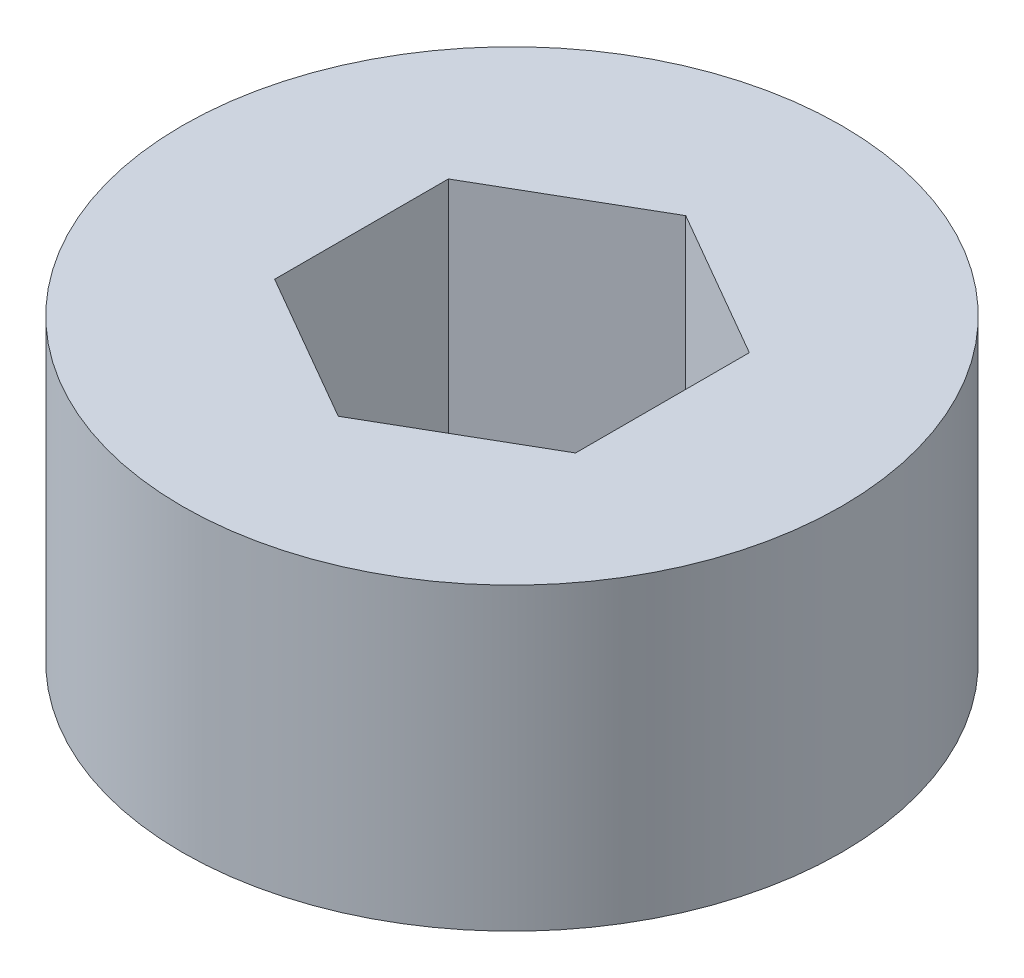
ISO-10303-21;
HEADER;
FILE_DESCRIPTION(('STEP AP214'),'2;1');
FILE_NAME('part.step','',(''),(''),'','','');
FILE_SCHEMA(('AUTOMOTIVE_DESIGN { 1 0 10303 214 1 1 1 1 }'));
ENDSEC;
DATA;
#1=APPLICATION_CONTEXT('core data for automotive mechanical design processes');
#2=APPLICATION_PROTOCOL_DEFINITION('international standard','automotive_design',2000,#1);
#3=PRODUCT_CONTEXT('',#1,'mechanical');
#4=PRODUCT('Part','Part','',(#3));
#5=PRODUCT_RELATED_PRODUCT_CATEGORY('part','',(#4));
#6=PRODUCT_DEFINITION_FORMATION('','',#4);
#7=PRODUCT_DEFINITION_CONTEXT('part definition',#1,'design');
#8=PRODUCT_DEFINITION('design','',#6,#7);
#9=PRODUCT_DEFINITION_SHAPE('','',#8);
#10=(LENGTH_UNIT() NAMED_UNIT(*) SI_UNIT(.MILLI.,.METRE.));
#11=(NAMED_UNIT(*) PLANE_ANGLE_UNIT() SI_UNIT($,.RADIAN.));
#12=(NAMED_UNIT(*) SI_UNIT($,.STERADIAN.) SOLID_ANGLE_UNIT());
#13=UNCERTAINTY_MEASURE_WITH_UNIT(LENGTH_MEASURE(1.E-05),#10,'distance_accuracy_value','');
#14=(GEOMETRIC_REPRESENTATION_CONTEXT(3) GLOBAL_UNCERTAINTY_ASSIGNED_CONTEXT((#13)) GLOBAL_UNIT_ASSIGNED_CONTEXT((#10,
#11,#12)) REPRESENTATION_CONTEXT('',''));
#15=CARTESIAN_POINT('',(0.,0.,0.));
#16=DIRECTION('',(0.,0.,1.));
#17=DIRECTION('',(1.,0.,0.));
#18=AXIS2_PLACEMENT_3D('',#15,#16,#17);
#19=CARTESIAN_POINT('',(0.,12.7,0.));
#20=DIRECTION('',(0.,-1.,0.));
#21=DIRECTION('',(0.,0.,-1.));
#22=AXIS2_PLACEMENT_3D('',#19,#20,#21);
#23=CYLINDRICAL_SURFACE('',#22,13.97);
#24=CARTESIAN_POINT('',(0.,12.7,0.));
#25=DIRECTION('',(0.,1.,0.));
#26=DIRECTION('',(0.,0.,1.));
#27=AXIS2_PLACEMENT_3D('',#24,#25,#26);
#28=CIRCLE('',#27,13.97);
#29=CARTESIAN_POINT('',(0.,12.7,13.97));
#30=VERTEX_POINT('',#29);
#31=EDGE_CURVE('E11',#30,#30,#28,.T.);
#32=ORIENTED_EDGE('',*,*,#31,.F.);
#33=EDGE_LOOP('',(#32));
#34=FACE_BOUND('',#33,.T.);
#35=CARTESIAN_POINT('',(0.,0.,0.));
#36=DIRECTION('',(0.,1.,0.));
#37=DIRECTION('',(0.,0.,1.));
#38=AXIS2_PLACEMENT_3D('',#35,#36,#37);
#39=CIRCLE('',#38,13.97);
#40=CARTESIAN_POINT('',(0.,0.,13.97));
#41=VERTEX_POINT('',#40);
#42=EDGE_CURVE('E38',#41,#41,#39,.T.);
#43=ORIENTED_EDGE('',*,*,#42,.T.);
#44=EDGE_LOOP('',(#43));
#45=FACE_BOUND('',#44,.T.);
#46=ADVANCED_FACE('F35',(#34,#45),#23,.T.);
#47=CARTESIAN_POINT('',(0.,12.7,0.));
#48=DIRECTION('',(0.,1.,0.));
#49=DIRECTION('',(0.,0.,1.));
#50=AXIS2_PLACEMENT_3D('',#47,#48,#49);
#51=PLANE('',#50);
#52=DIRECTION('',(-0.866025403784439,0.,-0.5));
#53=VECTOR('',#52,1.);
#54=CARTESIAN_POINT('',(6.37539999999999,12.7,-3.68083890619154));
#55=LINE('',#54,#53);
#56=CARTESIAN_POINT('',(6.37539999999999,12.7,-3.68083890619154));
#57=VERTEX_POINT('',#56);
#58=CARTESIAN_POINT('',(0.,12.7,-7.36167781238308));
#59=VERTEX_POINT('',#58);
#60=EDGE_CURVE('E49',#57,#59,#55,.T.);
#61=ORIENTED_EDGE('',*,*,#60,.F.);
#62=DIRECTION('',(0.,0.,-1.));
#63=VECTOR('',#62,1.);
#64=CARTESIAN_POINT('',(6.3754,12.7,3.68083890619154));
#65=LINE('',#64,#63);
#66=CARTESIAN_POINT('',(6.3754,12.7,3.68083890619154));
#67=VERTEX_POINT('',#66);
#68=EDGE_CURVE('E106',#67,#57,#65,.T.);
#69=ORIENTED_EDGE('',*,*,#68,.F.);
#70=DIRECTION('',(0.866025403784439,0.,-0.5));
#71=VECTOR('',#70,1.);
#72=CARTESIAN_POINT('',(0.,12.7,7.36167781238308));
#73=LINE('',#72,#71);
#74=CARTESIAN_POINT('',(0.,12.7,7.36167781238308));
#75=VERTEX_POINT('',#74);
#76=EDGE_CURVE('E109',#75,#67,#73,.T.);
#77=ORIENTED_EDGE('',*,*,#76,.F.);
#78=DIRECTION('',(0.866025403784439,0.,0.5));
#79=VECTOR('',#78,1.);
#80=CARTESIAN_POINT('',(-6.3754,12.7,3.68083890619154));
#81=LINE('',#80,#79);
#82=CARTESIAN_POINT('',(-6.3754,12.7,3.68083890619154));
#83=VERTEX_POINT('',#82);
#84=EDGE_CURVE('E125',#83,#75,#81,.T.);
#85=ORIENTED_EDGE('',*,*,#84,.F.);
#86=DIRECTION('',(0.,0.,1.));
#87=VECTOR('',#86,1.);
#88=CARTESIAN_POINT('',(-6.3754,12.7,-3.68083890619154));
#89=LINE('',#88,#87);
#90=CARTESIAN_POINT('',(-6.3754,12.7,-3.68083890619154));
#91=VERTEX_POINT('',#90);
#92=EDGE_CURVE('E122',#91,#83,#89,.T.);
#93=ORIENTED_EDGE('',*,*,#92,.F.);
#94=DIRECTION('',(-0.866025403784439,0.,0.5));
#95=VECTOR('',#94,1.);
#96=CARTESIAN_POINT('',(0.,12.7,-7.36167781238308));
#97=LINE('',#96,#95);
#98=EDGE_CURVE('E120',#59,#91,#97,.T.);
#99=ORIENTED_EDGE('',*,*,#98,.F.);
#100=EDGE_LOOP('',(#61,#69,#77,#85,#93,#99));
#101=FACE_BOUND('',#100,.T.);
#102=ORIENTED_EDGE('',*,*,#31,.T.);
#103=EDGE_LOOP('',(#102));
#104=FACE_BOUND('',#103,.T.);
#105=ADVANCED_FACE('F142',(#101,#104),#51,.T.);
#106=CARTESIAN_POINT('',(0.,0.,0.));
#107=DIRECTION('',(0.,1.,0.));
#108=DIRECTION('',(0.,0.,1.));
#109=AXIS2_PLACEMENT_3D('',#106,#107,#108);
#110=PLANE('',#109);
#111=DIRECTION('',(0.,0.,-1.));
#112=VECTOR('',#111,1.);
#113=CARTESIAN_POINT('',(6.3754,0.,3.68083890619154));
#114=LINE('',#113,#112);
#115=CARTESIAN_POINT('',(6.3754,0.,3.68083890619154));
#116=VERTEX_POINT('',#115);
#117=CARTESIAN_POINT('',(6.37539999999999,0.,-3.68083890619154));
#118=VERTEX_POINT('',#117);
#119=EDGE_CURVE('E95',#116,#118,#114,.T.);
#120=ORIENTED_EDGE('',*,*,#119,.T.);
#121=DIRECTION('',(-0.866025403784439,0.,-0.5));
#122=VECTOR('',#121,1.);
#123=CARTESIAN_POINT('',(6.37539999999999,0.,-3.68083890619154));
#124=LINE('',#123,#122);
#125=CARTESIAN_POINT('',(0.,0.,-7.36167781238308));
#126=VERTEX_POINT('',#125);
#127=EDGE_CURVE('E89',#118,#126,#124,.T.);
#128=ORIENTED_EDGE('',*,*,#127,.T.);
#129=DIRECTION('',(-0.866025403784439,0.,0.5));
#130=VECTOR('',#129,1.);
#131=CARTESIAN_POINT('',(0.,0.,-7.36167781238308));
#132=LINE('',#131,#130);
#133=CARTESIAN_POINT('',(-6.3754,0.,-3.68083890619154));
#134=VERTEX_POINT('',#133);
#135=EDGE_CURVE('E98',#126,#134,#132,.T.);
#136=ORIENTED_EDGE('',*,*,#135,.T.);
#137=DIRECTION('',(0.,0.,1.));
#138=VECTOR('',#137,1.);
#139=CARTESIAN_POINT('',(-6.3754,0.,-3.68083890619154));
#140=LINE('',#139,#138);
#141=CARTESIAN_POINT('',(-6.3754,0.,3.68083890619154));
#142=VERTEX_POINT('',#141);
#143=EDGE_CURVE('E57',#134,#142,#140,.T.);
#144=ORIENTED_EDGE('',*,*,#143,.T.);
#145=DIRECTION('',(0.866025403784439,0.,0.5));
#146=VECTOR('',#145,1.);
#147=CARTESIAN_POINT('',(-6.3754,0.,3.68083890619154));
#148=LINE('',#147,#146);
#149=CARTESIAN_POINT('',(0.,0.,7.36167781238308));
#150=VERTEX_POINT('',#149);
#151=EDGE_CURVE('E113',#142,#150,#148,.T.);
#152=ORIENTED_EDGE('',*,*,#151,.T.);
#153=DIRECTION('',(0.866025403784439,0.,-0.5));
#154=VECTOR('',#153,1.);
#155=CARTESIAN_POINT('',(0.,0.,7.36167781238308));
#156=LINE('',#155,#154);
#157=EDGE_CURVE('E116',#150,#116,#156,.T.);
#158=ORIENTED_EDGE('',*,*,#157,.T.);
#159=EDGE_LOOP('',(#120,#128,#136,#144,#152,#158));
#160=FACE_BOUND('',#159,.T.);
#161=ORIENTED_EDGE('',*,*,#42,.F.);
#162=EDGE_LOOP('',(#161));
#163=FACE_BOUND('',#162,.T.);
#164=ADVANCED_FACE('F102',(#160,#163),#110,.F.);
#165=CARTESIAN_POINT('',(6.37539999999999,0.,-3.68083890619154));
#166=DIRECTION('',(0.5,0.,-0.866025403784439));
#167=DIRECTION('',(-0.866025403784439,0.,-0.5));
#168=AXIS2_PLACEMENT_3D('',#165,#166,#167);
#169=PLANE('',#168);
#170=ORIENTED_EDGE('',*,*,#60,.T.);
#171=DIRECTION('',(0.,1.,0.));
#172=VECTOR('',#171,1.);
#173=CARTESIAN_POINT('',(0.,0.,-7.36167781238308));
#174=LINE('',#173,#172);
#175=EDGE_CURVE('E85',#126,#59,#174,.T.);
#176=ORIENTED_EDGE('',*,*,#175,.F.);
#177=ORIENTED_EDGE('',*,*,#127,.F.);
#178=DIRECTION('',(0.,1.,0.));
#179=VECTOR('',#178,1.);
#180=CARTESIAN_POINT('',(6.37539999999999,0.,-3.68083890619154));
#181=LINE('',#180,#179);
#182=EDGE_CURVE('E130',#118,#57,#181,.T.);
#183=ORIENTED_EDGE('',*,*,#182,.T.);
#184=EDGE_LOOP('',(#170,#176,#177,#183));
#185=FACE_BOUND('',#184,.T.);
#186=ADVANCED_FACE('F87',(#185),#169,.F.);
#187=CARTESIAN_POINT('',(6.3754,0.,3.68083890619154));
#188=DIRECTION('',(1.,0.,0.));
#189=DIRECTION('',(0.,0.,-1.));
#190=AXIS2_PLACEMENT_3D('',#187,#188,#189);
#191=PLANE('',#190);
#192=ORIENTED_EDGE('',*,*,#68,.T.);
#193=ORIENTED_EDGE('',*,*,#182,.F.);
#194=ORIENTED_EDGE('',*,*,#119,.F.);
#195=DIRECTION('',(0.,1.,0.));
#196=VECTOR('',#195,1.);
#197=CARTESIAN_POINT('',(6.3754,0.,3.68083890619154));
#198=LINE('',#197,#196);
#199=EDGE_CURVE('E132',#116,#67,#198,.T.);
#200=ORIENTED_EDGE('',*,*,#199,.T.);
#201=EDGE_LOOP('',(#192,#193,#194,#200));
#202=FACE_BOUND('',#201,.T.);
#203=ADVANCED_FACE('F153',(#202),#191,.F.);
#204=CARTESIAN_POINT('',(0.,0.,7.36167781238308));
#205=DIRECTION('',(0.5,0.,0.866025403784439));
#206=DIRECTION('',(0.866025403784439,0.,-0.5));
#207=AXIS2_PLACEMENT_3D('',#204,#205,#206);
#208=PLANE('',#207);
#209=ORIENTED_EDGE('',*,*,#76,.T.);
#210=ORIENTED_EDGE('',*,*,#199,.F.);
#211=ORIENTED_EDGE('',*,*,#157,.F.);
#212=DIRECTION('',(0.,1.,0.));
#213=VECTOR('',#212,1.);
#214=CARTESIAN_POINT('',(0.,0.,7.36167781238308));
#215=LINE('',#214,#213);
#216=EDGE_CURVE('E134',#150,#75,#215,.T.);
#217=ORIENTED_EDGE('',*,*,#216,.T.);
#218=EDGE_LOOP('',(#209,#210,#211,#217));
#219=FACE_BOUND('',#218,.T.);
#220=ADVANCED_FACE('F151',(#219),#208,.F.);
#221=CARTESIAN_POINT('',(-6.3754,0.,3.68083890619154));
#222=DIRECTION('',(-0.5,0.,0.866025403784439));
#223=DIRECTION('',(0.866025403784439,0.,0.5));
#224=AXIS2_PLACEMENT_3D('',#221,#222,#223);
#225=PLANE('',#224);
#226=ORIENTED_EDGE('',*,*,#84,.T.);
#227=ORIENTED_EDGE('',*,*,#216,.F.);
#228=ORIENTED_EDGE('',*,*,#151,.F.);
#229=DIRECTION('',(0.,1.,0.));
#230=VECTOR('',#229,1.);
#231=CARTESIAN_POINT('',(-6.3754,0.,3.68083890619154));
#232=LINE('',#231,#230);
#233=EDGE_CURVE('E136',#142,#83,#232,.T.);
#234=ORIENTED_EDGE('',*,*,#233,.T.);
#235=EDGE_LOOP('',(#226,#227,#228,#234));
#236=FACE_BOUND('',#235,.T.);
#237=ADVANCED_FACE('F147',(#236),#225,.F.);
#238=CARTESIAN_POINT('',(-6.3754,0.,-3.68083890619154));
#239=DIRECTION('',(-1.,0.,0.));
#240=DIRECTION('',(0.,0.,1.));
#241=AXIS2_PLACEMENT_3D('',#238,#239,#240);
#242=PLANE('',#241);
#243=ORIENTED_EDGE('',*,*,#92,.T.);
#244=ORIENTED_EDGE('',*,*,#233,.F.);
#245=ORIENTED_EDGE('',*,*,#143,.F.);
#246=DIRECTION('',(0.,1.,0.));
#247=VECTOR('',#246,1.);
#248=CARTESIAN_POINT('',(-6.3754,0.,-3.68083890619154));
#249=LINE('',#248,#247);
#250=EDGE_CURVE('E94',#134,#91,#249,.T.);
#251=ORIENTED_EDGE('',*,*,#250,.T.);
#252=EDGE_LOOP('',(#243,#244,#245,#251));
#253=FACE_BOUND('',#252,.T.);
#254=ADVANCED_FACE('F138',(#253),#242,.F.);
#255=CARTESIAN_POINT('',(0.,0.,-7.36167781238308));
#256=DIRECTION('',(-0.5,0.,-0.866025403784438));
#257=DIRECTION('',(-0.866025403784439,0.,0.5));
#258=AXIS2_PLACEMENT_3D('',#255,#256,#257);
#259=PLANE('',#258);
#260=ORIENTED_EDGE('',*,*,#98,.T.);
#261=ORIENTED_EDGE('',*,*,#250,.F.);
#262=ORIENTED_EDGE('',*,*,#135,.F.);
#263=ORIENTED_EDGE('',*,*,#175,.T.);
#264=EDGE_LOOP('',(#260,#261,#262,#263));
#265=FACE_BOUND('',#264,.T.);
#266=ADVANCED_FACE('F99',(#265),#259,.F.);
#267=CLOSED_SHELL('',(#46,#105,#164,#186,#203,#220,#237,#254,#266));
#268=MANIFOLD_SOLID_BREP('B2',#267);
#269=ADVANCED_BREP_SHAPE_REPRESENTATION('',(#18,#268),#14);
#270=SHAPE_DEFINITION_REPRESENTATION(#9,#269);
ENDSEC;
END-ISO-10303-21;
